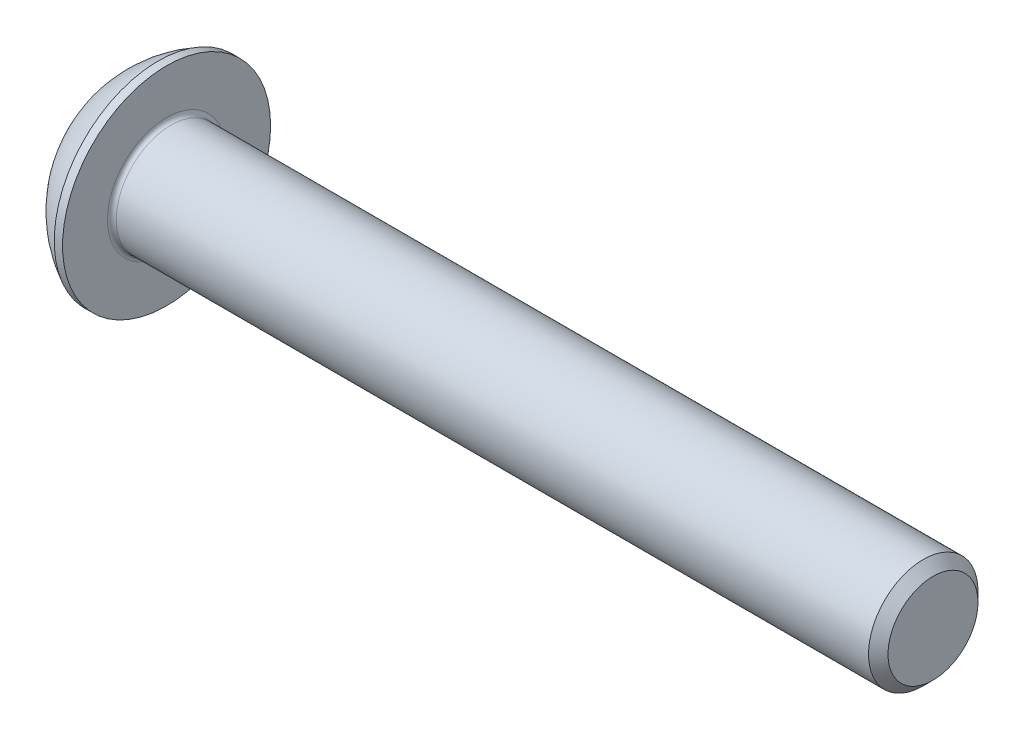
ISO-10303-21;
HEADER;
FILE_DESCRIPTION(('STEP AP214'),'2;1');
FILE_NAME('part.step','',(''),(''),'','','');
FILE_SCHEMA(('AUTOMOTIVE_DESIGN { 1 0 10303 214 1 1 1 1 }'));
ENDSEC;
DATA;
#1=APPLICATION_CONTEXT('core data for automotive mechanical design processes');
#2=APPLICATION_PROTOCOL_DEFINITION('international standard','automotive_design',2000,#1);
#3=PRODUCT_CONTEXT('',#1,'mechanical');
#4=PRODUCT('Part','Part','',(#3));
#5=PRODUCT_RELATED_PRODUCT_CATEGORY('part','',(#4));
#6=PRODUCT_DEFINITION_FORMATION('','',#4);
#7=PRODUCT_DEFINITION_CONTEXT('part definition',#1,'design');
#8=PRODUCT_DEFINITION('design','',#6,#7);
#9=PRODUCT_DEFINITION_SHAPE('','',#8);
#10=(LENGTH_UNIT() NAMED_UNIT(*) SI_UNIT(.MILLI.,.METRE.));
#11=(NAMED_UNIT(*) PLANE_ANGLE_UNIT() SI_UNIT($,.RADIAN.));
#12=(NAMED_UNIT(*) SI_UNIT($,.STERADIAN.) SOLID_ANGLE_UNIT());
#13=UNCERTAINTY_MEASURE_WITH_UNIT(LENGTH_MEASURE(1.E-05),#10,'distance_accuracy_value','');
#14=(GEOMETRIC_REPRESENTATION_CONTEXT(3) GLOBAL_UNCERTAINTY_ASSIGNED_CONTEXT((#13)) GLOBAL_UNIT_ASSIGNED_CONTEXT((#10,
#11,#12)) REPRESENTATION_CONTEXT('',''));
#15=CARTESIAN_POINT('',(0.,0.,0.));
#16=DIRECTION('',(0.,0.,1.));
#17=DIRECTION('',(1.,0.,0.));
#18=AXIS2_PLACEMENT_3D('',#15,#16,#17);
#19=CARTESIAN_POINT('',(4.75485015536768,0.,0.));
#20=DIRECTION('',(1.,0.,0.));
#21=DIRECTION('',(0.,1.,0.));
#22=AXIS2_PLACEMENT_3D('',#19,#20,#21);
#23=SPHERICAL_SURFACE('',#22,5.315);
#24=CARTESIAN_POINT('',(0.,0.,0.));
#25=DIRECTION('',(1.,0.,0.));
#26=DIRECTION('',(0.,0.,-1.));
#27=AXIS2_PLACEMENT_3D('',#24,#25,#26);
#28=CIRCLE('',#27,2.375);
#29=CARTESIAN_POINT('',(0.,0.,-2.375));
#30=VERTEX_POINT('',#29);
#31=EDGE_CURVE('E190',#30,#30,#28,.T.);
#32=ORIENTED_EDGE('',*,*,#31,.T.);
#33=EDGE_LOOP('',(#32));
#34=FACE_BOUND('',#33,.T.);
#35=CARTESIAN_POINT('',(2.37016464151056,0.,0.));
#36=DIRECTION('',(1.,0.,0.));
#37=DIRECTION('',(0.,0.,-1.));
#38=AXIS2_PLACEMENT_3D('',#35,#36,#37);
#39=CIRCLE('',#38,4.75);
#40=CARTESIAN_POINT('',(2.37016464151056,0.,-4.75));
#41=VERTEX_POINT('',#40);
#42=EDGE_CURVE('E177',#41,#41,#39,.T.);
#43=ORIENTED_EDGE('',*,*,#42,.F.);
#44=EDGE_LOOP('',(#43));
#45=FACE_BOUND('',#44,.T.);
#46=ADVANCED_FACE('F34',(#34,#45),#23,.T.);
#47=CARTESIAN_POINT('',(0.,2.375,0.));
#48=DIRECTION('',(-1.,0.,0.));
#49=DIRECTION('',(0.,0.,1.));
#50=AXIS2_PLACEMENT_3D('',#47,#48,#49);
#51=PLANE('',#50);
#52=DIRECTION('',(0.,0.5,-0.866025403784439));
#53=VECTOR('',#52,1.);
#54=CARTESIAN_POINT('',(0.,0.866025403784439,1.5));
#55=LINE('',#54,#53);
#56=CARTESIAN_POINT('',(0.,0.866025403784439,1.5));
#57=VERTEX_POINT('',#56);
#58=CARTESIAN_POINT('',(0.,1.73205080756888,0.));
#59=VERTEX_POINT('',#58);
#60=EDGE_CURVE('E156',#57,#59,#55,.T.);
#61=ORIENTED_EDGE('',*,*,#60,.F.);
#62=DIRECTION('',(0.,1.,0.));
#63=VECTOR('',#62,1.);
#64=CARTESIAN_POINT('',(0.,-0.866025403784438,1.5));
#65=LINE('',#64,#63);
#66=CARTESIAN_POINT('',(0.,-0.866025403784438,1.5));
#67=VERTEX_POINT('',#66);
#68=EDGE_CURVE('E153',#67,#57,#65,.T.);
#69=ORIENTED_EDGE('',*,*,#68,.F.);
#70=DIRECTION('',(0.,0.5,0.866025403784438));
#71=VECTOR('',#70,1.);
#72=CARTESIAN_POINT('',(0.,-1.73205080756888,0.));
#73=LINE('',#72,#71);
#74=CARTESIAN_POINT('',(0.,-1.73205080756888,0.));
#75=VERTEX_POINT('',#74);
#76=EDGE_CURVE('E151',#75,#67,#73,.T.);
#77=ORIENTED_EDGE('',*,*,#76,.F.);
#78=DIRECTION('',(0.,-0.5,0.866025403784438));
#79=VECTOR('',#78,1.);
#80=CARTESIAN_POINT('',(0.,-0.866025403784438,-1.5));
#81=LINE('',#80,#79);
#82=CARTESIAN_POINT('',(0.,-0.866025403784438,-1.5));
#83=VERTEX_POINT('',#82);
#84=EDGE_CURVE('E149',#83,#75,#81,.T.);
#85=ORIENTED_EDGE('',*,*,#84,.F.);
#86=DIRECTION('',(0.,-1.,0.));
#87=VECTOR('',#86,1.);
#88=CARTESIAN_POINT('',(0.,0.866025403784438,-1.5));
#89=LINE('',#88,#87);
#90=CARTESIAN_POINT('',(0.,0.866025403784438,-1.5));
#91=VERTEX_POINT('',#90);
#92=EDGE_CURVE('E123',#91,#83,#89,.T.);
#93=ORIENTED_EDGE('',*,*,#92,.F.);
#94=DIRECTION('',(0.,-0.5,-0.866025403784438));
#95=VECTOR('',#94,1.);
#96=CARTESIAN_POINT('',(0.,1.73205080756888,0.));
#97=LINE('',#96,#95);
#98=EDGE_CURVE('E116',#59,#91,#97,.T.);
#99=ORIENTED_EDGE('',*,*,#98,.F.);
#100=EDGE_LOOP('',(#61,#69,#77,#85,#93,#99));
#101=FACE_BOUND('',#100,.T.);
#102=ORIENTED_EDGE('',*,*,#31,.F.);
#103=EDGE_LOOP('',(#102));
#104=FACE_BOUND('',#103,.T.);
#105=ADVANCED_FACE('F212',(#101,#104),#51,.T.);
#106=CARTESIAN_POINT('',(37.75,0.,0.));
#107=DIRECTION('',(1.,0.,0.));
#108=DIRECTION('',(0.,0.,-1.));
#109=AXIS2_PLACEMENT_3D('',#106,#107,#108);
#110=PLANE('',#109);
#111=CARTESIAN_POINT('',(37.75,0.,0.));
#112=DIRECTION('',(1.,0.,0.));
#113=DIRECTION('',(0.,0.,-1.));
#114=AXIS2_PLACEMENT_3D('',#111,#112,#113);
#115=CIRCLE('',#114,2.05500000000001);
#116=CARTESIAN_POINT('',(37.75,0.,-2.05500000000001));
#117=VERTEX_POINT('',#116);
#118=EDGE_CURVE('E187',#117,#117,#115,.T.);
#119=ORIENTED_EDGE('',*,*,#118,.T.);
#120=EDGE_LOOP('',(#119));
#121=FACE_BOUND('',#120,.T.);
#122=ADVANCED_FACE('F217',(#121),#110,.T.);
#123=CARTESIAN_POINT('',(37.75,0.,0.));
#124=DIRECTION('',(-1.,0.,0.));
#125=DIRECTION('',(0.,0.,1.));
#126=AXIS2_PLACEMENT_3D('',#123,#124,#125);
#127=CONICAL_SURFACE('',#126,2.05500000000001,0.785398163397447);
#128=CARTESIAN_POINT('',(37.305,0.,0.));
#129=DIRECTION('',(1.,0.,0.));
#130=DIRECTION('',(0.,0.,-1.));
#131=AXIS2_PLACEMENT_3D('',#128,#129,#130);
#132=CIRCLE('',#131,2.5);
#133=CARTESIAN_POINT('',(37.305,0.,-2.5));
#134=VERTEX_POINT('',#133);
#135=EDGE_CURVE('E184',#134,#134,#132,.T.);
#136=ORIENTED_EDGE('',*,*,#135,.T.);
#137=EDGE_LOOP('',(#136));
#138=FACE_BOUND('',#137,.T.);
#139=ORIENTED_EDGE('',*,*,#118,.F.);
#140=EDGE_LOOP('',(#139));
#141=FACE_BOUND('',#140,.T.);
#142=ADVANCED_FACE('F224',(#138,#141),#127,.T.);
#143=CARTESIAN_POINT('',(-3.64348996551984,0.,0.));
#144=DIRECTION('',(1.,0.,0.));
#145=DIRECTION('',(0.,0.,-1.));
#146=AXIS2_PLACEMENT_3D('',#143,#144,#145);
#147=CYLINDRICAL_SURFACE('',#146,2.5);
#148=CARTESIAN_POINT('',(2.95,0.,0.));
#149=DIRECTION('',(1.,0.,0.));
#150=DIRECTION('',(0.,0.,-1.));
#151=AXIS2_PLACEMENT_3D('',#148,#149,#150);
#152=CIRCLE('',#151,2.5);
#153=CARTESIAN_POINT('',(2.95,0.,-2.5));
#154=VERTEX_POINT('',#153);
#155=EDGE_CURVE('E42',#154,#154,#152,.T.);
#156=ORIENTED_EDGE('',*,*,#155,.T.);
#157=EDGE_LOOP('',(#156));
#158=FACE_BOUND('',#157,.T.);
#159=ORIENTED_EDGE('',*,*,#135,.F.);
#160=EDGE_LOOP('',(#159));
#161=FACE_BOUND('',#160,.T.);
#162=ADVANCED_FACE('F195',(#158,#161),#147,.T.);
#163=CARTESIAN_POINT('',(2.75,2.5,0.));
#164=DIRECTION('',(1.,0.,0.));
#165=DIRECTION('',(0.,0.,-1.));
#166=AXIS2_PLACEMENT_3D('',#163,#164,#165);
#167=PLANE('',#166);
#168=CARTESIAN_POINT('',(2.75,0.,0.));
#169=DIRECTION('',(1.,0.,0.));
#170=DIRECTION('',(0.,0.,-1.));
#171=AXIS2_PLACEMENT_3D('',#168,#169,#170);
#172=CIRCLE('',#171,2.7);
#173=CARTESIAN_POINT('',(2.75,0.,-2.7));
#174=VERTEX_POINT('',#173);
#175=EDGE_CURVE('E11',#174,#174,#172,.F.);
#176=ORIENTED_EDGE('',*,*,#175,.T.);
#177=EDGE_LOOP('',(#176));
#178=FACE_BOUND('',#177,.T.);
#179=CARTESIAN_POINT('',(2.75,0.,0.));
#180=DIRECTION('',(1.,0.,0.));
#181=DIRECTION('',(0.,0.,-1.));
#182=AXIS2_PLACEMENT_3D('',#179,#180,#181);
#183=CIRCLE('',#182,4.75);
#184=CARTESIAN_POINT('',(2.75,0.,-4.75));
#185=VERTEX_POINT('',#184);
#186=EDGE_CURVE('E181',#185,#185,#183,.T.);
#187=ORIENTED_EDGE('',*,*,#186,.T.);
#188=EDGE_LOOP('',(#187));
#189=FACE_BOUND('',#188,.T.);
#190=ADVANCED_FACE('F207',(#178,#189),#167,.T.);
#191=CARTESIAN_POINT('',(-3.64348996551984,0.,0.));
#192=DIRECTION('',(1.,0.,0.));
#193=DIRECTION('',(0.,0.,-1.));
#194=AXIS2_PLACEMENT_3D('',#191,#192,#193);
#195=CYLINDRICAL_SURFACE('',#194,4.75);
#196=ORIENTED_EDGE('',*,*,#42,.T.);
#197=EDGE_LOOP('',(#196));
#198=FACE_BOUND('',#197,.T.);
#199=ORIENTED_EDGE('',*,*,#186,.F.);
#200=EDGE_LOOP('',(#199));
#201=FACE_BOUND('',#200,.T.);
#202=ADVANCED_FACE('F199',(#198,#201),#195,.T.);
#203=CARTESIAN_POINT('',(2.95,0.,0.));
#204=DIRECTION('',(1.,0.,0.));
#205=DIRECTION('',(0.,0.,-1.));
#206=AXIS2_PLACEMENT_3D('',#203,#204,#205);
#207=TOROIDAL_SURFACE('',#206,2.7,0.2);
#208=ORIENTED_EDGE('',*,*,#175,.F.);
#209=EDGE_LOOP('',(#208));
#210=FACE_BOUND('',#209,.T.);
#211=ORIENTED_EDGE('',*,*,#155,.F.);
#212=EDGE_LOOP('',(#211));
#213=FACE_BOUND('',#212,.T.);
#214=ADVANCED_FACE('F36',(#210,#213),#207,.F.);
#215=CARTESIAN_POINT('',(1.56,0.866025403784438,-1.5));
#216=DIRECTION('',(0.,0.,-1.));
#217=DIRECTION('',(-1.,0.,0.));
#218=AXIS2_PLACEMENT_3D('',#215,#216,#217);
#219=PLANE('',#218);
#220=DIRECTION('',(0.,-1.,0.));
#221=VECTOR('',#220,1.);
#222=CARTESIAN_POINT('',(1.56,0.866025403784438,-1.5));
#223=LINE('',#222,#221);
#224=CARTESIAN_POINT('',(1.56,0.866025403784438,-1.5));
#225=VERTEX_POINT('',#224);
#226=CARTESIAN_POINT('',(1.56,0.,-1.5));
#227=VERTEX_POINT('',#226);
#228=EDGE_CURVE('E115',#225,#227,#223,.T.);
#229=ORIENTED_EDGE('',*,*,#228,.F.);
#230=DIRECTION('',(-1.,0.,0.));
#231=VECTOR('',#230,1.);
#232=CARTESIAN_POINT('',(1.56,0.866025403784438,-1.5));
#233=LINE('',#232,#231);
#234=EDGE_CURVE('E161',#225,#91,#233,.T.);
#235=ORIENTED_EDGE('',*,*,#234,.T.);
#236=ORIENTED_EDGE('',*,*,#92,.T.);
#237=DIRECTION('',(-1.,0.,0.));
#238=VECTOR('',#237,1.);
#239=CARTESIAN_POINT('',(1.56,-0.866025403784438,-1.5));
#240=LINE('',#239,#238);
#241=CARTESIAN_POINT('',(1.56,-0.866025403784438,-1.5));
#242=VERTEX_POINT('',#241);
#243=EDGE_CURVE('E120',#242,#83,#240,.T.);
#244=ORIENTED_EDGE('',*,*,#243,.F.);
#245=EDGE_CURVE('E105',#227,#242,#223,.T.);
#246=ORIENTED_EDGE('',*,*,#245,.F.);
#247=EDGE_LOOP('',(#229,#235,#236,#244,#246));
#248=FACE_BOUND('',#247,.T.);
#249=ADVANCED_FACE('F121',(#248),#219,.F.);
#250=CARTESIAN_POINT('',(1.56,1.73205080756888,0.));
#251=DIRECTION('',(0.,0.866025403784438,-0.5));
#252=DIRECTION('',(0.,0.5,0.866025403784439));
#253=AXIS2_PLACEMENT_3D('',#250,#251,#252);
#254=PLANE('',#253);
#255=DIRECTION('',(0.,-0.5,-0.866025403784438));
#256=VECTOR('',#255,1.);
#257=CARTESIAN_POINT('',(1.56,1.73205080756888,0.));
#258=LINE('',#257,#256);
#259=CARTESIAN_POINT('',(1.56,1.73205080756888,0.));
#260=VERTEX_POINT('',#259);
#261=CARTESIAN_POINT('',(1.56,1.29903810567666,-0.75));
#262=VERTEX_POINT('',#261);
#263=EDGE_CURVE('E127',#260,#262,#258,.T.);
#264=ORIENTED_EDGE('',*,*,#263,.F.);
#265=DIRECTION('',(-1.,0.,0.));
#266=VECTOR('',#265,1.);
#267=CARTESIAN_POINT('',(1.56,1.73205080756888,0.));
#268=LINE('',#267,#266);
#269=EDGE_CURVE('E164',#260,#59,#268,.T.);
#270=ORIENTED_EDGE('',*,*,#269,.T.);
#271=ORIENTED_EDGE('',*,*,#98,.T.);
#272=ORIENTED_EDGE('',*,*,#234,.F.);
#273=EDGE_CURVE('E145',#262,#225,#258,.T.);
#274=ORIENTED_EDGE('',*,*,#273,.F.);
#275=EDGE_LOOP('',(#264,#270,#271,#272,#274));
#276=FACE_BOUND('',#275,.T.);
#277=ADVANCED_FACE('F205',(#276),#254,.F.);
#278=CARTESIAN_POINT('',(1.56,0.866025403784439,1.5));
#279=DIRECTION('',(0.,0.866025403784439,0.5));
#280=DIRECTION('',(0.,-0.5,0.866025403784439));
#281=AXIS2_PLACEMENT_3D('',#278,#279,#280);
#282=PLANE('',#281);
#283=DIRECTION('',(0.,0.5,-0.866025403784439));
#284=VECTOR('',#283,1.);
#285=CARTESIAN_POINT('',(1.56,0.866025403784439,1.5));
#286=LINE('',#285,#284);
#287=CARTESIAN_POINT('',(1.56,0.866025403784439,1.5));
#288=VERTEX_POINT('',#287);
#289=CARTESIAN_POINT('',(1.56,1.29903810567666,0.75));
#290=VERTEX_POINT('',#289);
#291=EDGE_CURVE('E49',#288,#290,#286,.T.);
#292=ORIENTED_EDGE('',*,*,#291,.F.);
#293=DIRECTION('',(-1.,0.,0.));
#294=VECTOR('',#293,1.);
#295=CARTESIAN_POINT('',(1.56,0.866025403784439,1.5));
#296=LINE('',#295,#294);
#297=EDGE_CURVE('E167',#288,#57,#296,.T.);
#298=ORIENTED_EDGE('',*,*,#297,.T.);
#299=ORIENTED_EDGE('',*,*,#60,.T.);
#300=ORIENTED_EDGE('',*,*,#269,.F.);
#301=EDGE_CURVE('E143',#290,#260,#286,.T.);
#302=ORIENTED_EDGE('',*,*,#301,.F.);
#303=EDGE_LOOP('',(#292,#298,#299,#300,#302));
#304=FACE_BOUND('',#303,.T.);
#305=ADVANCED_FACE('F249',(#304),#282,.F.);
#306=CARTESIAN_POINT('',(1.56,-0.866025403784438,1.5));
#307=DIRECTION('',(0.,0.,1.));
#308=DIRECTION('',(0.,-1.,0.));
#309=AXIS2_PLACEMENT_3D('',#306,#307,#308);
#310=PLANE('',#309);
#311=DIRECTION('',(0.,1.,0.));
#312=VECTOR('',#311,1.);
#313=CARTESIAN_POINT('',(1.56,-0.866025403784438,1.5));
#314=LINE('',#313,#312);
#315=CARTESIAN_POINT('',(1.56,-0.866025403784438,1.5));
#316=VERTEX_POINT('',#315);
#317=CARTESIAN_POINT('',(1.56,0.,1.5));
#318=VERTEX_POINT('',#317);
#319=EDGE_CURVE('E140',#316,#318,#314,.T.);
#320=ORIENTED_EDGE('',*,*,#319,.F.);
#321=DIRECTION('',(-1.,0.,0.));
#322=VECTOR('',#321,1.);
#323=CARTESIAN_POINT('',(1.56,-0.866025403784438,1.5));
#324=LINE('',#323,#322);
#325=EDGE_CURVE('E170',#316,#67,#324,.T.);
#326=ORIENTED_EDGE('',*,*,#325,.T.);
#327=ORIENTED_EDGE('',*,*,#68,.T.);
#328=ORIENTED_EDGE('',*,*,#297,.F.);
#329=EDGE_CURVE('E139',#318,#288,#314,.T.);
#330=ORIENTED_EDGE('',*,*,#329,.F.);
#331=EDGE_LOOP('',(#320,#326,#327,#328,#330));
#332=FACE_BOUND('',#331,.T.);
#333=ADVANCED_FACE('F245',(#332),#310,.F.);
#334=CARTESIAN_POINT('',(1.56,-1.73205080756888,0.));
#335=DIRECTION('',(0.,-0.866025403784438,0.5));
#336=DIRECTION('',(0.,-0.5,-0.866025403784439));
#337=AXIS2_PLACEMENT_3D('',#334,#335,#336);
#338=PLANE('',#337);
#339=DIRECTION('',(0.,0.5,0.866025403784438));
#340=VECTOR('',#339,1.);
#341=CARTESIAN_POINT('',(1.56,-1.73205080756888,0.));
#342=LINE('',#341,#340);
#343=CARTESIAN_POINT('',(1.56,-1.73205080756888,0.));
#344=VERTEX_POINT('',#343);
#345=CARTESIAN_POINT('',(1.56,-1.29903810567666,0.75));
#346=VERTEX_POINT('',#345);
#347=EDGE_CURVE('E135',#344,#346,#342,.T.);
#348=ORIENTED_EDGE('',*,*,#347,.F.);
#349=DIRECTION('',(-1.,0.,0.));
#350=VECTOR('',#349,1.);
#351=CARTESIAN_POINT('',(1.56,-1.73205080756888,0.));
#352=LINE('',#351,#350);
#353=EDGE_CURVE('E126',#344,#75,#352,.T.);
#354=ORIENTED_EDGE('',*,*,#353,.T.);
#355=ORIENTED_EDGE('',*,*,#76,.T.);
#356=ORIENTED_EDGE('',*,*,#325,.F.);
#357=EDGE_CURVE('E133',#346,#316,#342,.T.);
#358=ORIENTED_EDGE('',*,*,#357,.F.);
#359=EDGE_LOOP('',(#348,#354,#355,#356,#358));
#360=FACE_BOUND('',#359,.T.);
#361=ADVANCED_FACE('F242',(#360),#338,.F.);
#362=CARTESIAN_POINT('',(1.56,-0.866025403784438,-1.5));
#363=DIRECTION('',(0.,-0.866025403784438,-0.5));
#364=DIRECTION('',(0.,0.5,-0.866025403784439));
#365=AXIS2_PLACEMENT_3D('',#362,#363,#364);
#366=PLANE('',#365);
#367=DIRECTION('',(0.,-0.5,0.866025403784438));
#368=VECTOR('',#367,1.);
#369=CARTESIAN_POINT('',(1.56,-0.866025403784438,-1.5));
#370=LINE('',#369,#368);
#371=CARTESIAN_POINT('',(1.56,-1.29903810567666,-0.75));
#372=VERTEX_POINT('',#371);
#373=EDGE_CURVE('E109',#242,#372,#370,.T.);
#374=ORIENTED_EDGE('',*,*,#373,.F.);
#375=ORIENTED_EDGE('',*,*,#243,.T.);
#376=ORIENTED_EDGE('',*,*,#84,.T.);
#377=ORIENTED_EDGE('',*,*,#353,.F.);
#378=EDGE_CURVE('E132',#372,#344,#370,.T.);
#379=ORIENTED_EDGE('',*,*,#378,.F.);
#380=EDGE_LOOP('',(#374,#375,#376,#377,#379));
#381=FACE_BOUND('',#380,.T.);
#382=ADVANCED_FACE('F130',(#381),#366,.F.);
#383=CARTESIAN_POINT('',(1.56,0.,0.));
#384=DIRECTION('',(-1.,0.,0.));
#385=DIRECTION('',(0.,0.,1.));
#386=AXIS2_PLACEMENT_3D('',#383,#384,#385);
#387=PLANE('',#386);
#388=CARTESIAN_POINT('',(1.56,0.,0.));
#389=DIRECTION('',(1.,0.,0.));
#390=DIRECTION('',(0.,1.,0.));
#391=AXIS2_PLACEMENT_3D('',#388,#389,#390);
#392=CIRCLE('',#391,1.5);
#393=EDGE_CURVE('E178',#318,#346,#392,.T.);
#394=ORIENTED_EDGE('',*,*,#393,.T.);
#395=ORIENTED_EDGE('',*,*,#357,.T.);
#396=ORIENTED_EDGE('',*,*,#319,.T.);
#397=EDGE_LOOP('',(#394,#395,#396));
#398=FACE_BOUND('',#397,.T.);
#399=ADVANCED_FACE('F241',(#398),#387,.T.);
#400=EDGE_CURVE('E280',#346,#372,#392,.T.);
#401=ORIENTED_EDGE('',*,*,#400,.T.);
#402=ORIENTED_EDGE('',*,*,#378,.T.);
#403=ORIENTED_EDGE('',*,*,#347,.T.);
#404=EDGE_LOOP('',(#401,#402,#403));
#405=FACE_BOUND('',#404,.T.);
#406=ADVANCED_FACE('F258',(#405),#387,.T.);
#407=EDGE_CURVE('E111',#372,#227,#392,.T.);
#408=ORIENTED_EDGE('',*,*,#407,.T.);
#409=ORIENTED_EDGE('',*,*,#245,.T.);
#410=ORIENTED_EDGE('',*,*,#373,.T.);
#411=EDGE_LOOP('',(#408,#409,#410));
#412=FACE_BOUND('',#411,.T.);
#413=ADVANCED_FACE('F107',(#412),#387,.T.);
#414=EDGE_CURVE('E281',#227,#262,#392,.T.);
#415=ORIENTED_EDGE('',*,*,#414,.T.);
#416=ORIENTED_EDGE('',*,*,#273,.T.);
#417=ORIENTED_EDGE('',*,*,#228,.T.);
#418=EDGE_LOOP('',(#415,#416,#417));
#419=FACE_BOUND('',#418,.T.);
#420=ADVANCED_FACE('F269',(#419),#387,.T.);
#421=EDGE_CURVE('E163',#262,#290,#392,.T.);
#422=ORIENTED_EDGE('',*,*,#421,.T.);
#423=ORIENTED_EDGE('',*,*,#301,.T.);
#424=ORIENTED_EDGE('',*,*,#263,.T.);
#425=EDGE_LOOP('',(#422,#423,#424));
#426=FACE_BOUND('',#425,.T.);
#427=ADVANCED_FACE('F265',(#426),#387,.T.);
#428=EDGE_CURVE('E175',#290,#318,#392,.T.);
#429=ORIENTED_EDGE('',*,*,#428,.T.);
#430=ORIENTED_EDGE('',*,*,#329,.T.);
#431=ORIENTED_EDGE('',*,*,#291,.T.);
#432=EDGE_LOOP('',(#429,#430,#431));
#433=FACE_BOUND('',#432,.T.);
#434=ADVANCED_FACE('F236',(#433),#387,.T.);
#435=CARTESIAN_POINT('',(2.42602540378445,0.,0.));
#436=DIRECTION('',(-1.,0.,0.));
#437=DIRECTION('',(0.,-1.,0.));
#438=AXIS2_PLACEMENT_3D('',#435,#436,#437);
#439=CONICAL_SURFACE('',#438,0.,1.04719755119659);
#440=ORIENTED_EDGE('',*,*,#428,.F.);
#441=ORIENTED_EDGE('',*,*,#421,.F.);
#442=ORIENTED_EDGE('',*,*,#414,.F.);
#443=ORIENTED_EDGE('',*,*,#407,.F.);
#444=ORIENTED_EDGE('',*,*,#400,.F.);
#445=ORIENTED_EDGE('',*,*,#393,.F.);
#446=EDGE_LOOP('',(#440,#441,#442,#443,#444,#445));
#447=FACE_BOUND('',#446,.T.);
#448=CARTESIAN_POINT('',(2.42602540378445,0.,0.));
#449=VERTEX_POINT('',#448);
#450=VERTEX_LOOP('',#449);
#451=FACE_BOUND('',#450,.T.);
#452=ADVANCED_FACE('F234',(#447,#451),#439,.F.);
#453=CLOSED_SHELL('',(#46,#105,#122,#142,#162,#190,#202,#214,#249,#277,#305,#333,#361,#382,#399,
#406,#413,#420,#427,#434,#452));
#454=MANIFOLD_SOLID_BREP('B2',#453);
#455=ADVANCED_BREP_SHAPE_REPRESENTATION('',(#18,#454),#14);
#456=SHAPE_DEFINITION_REPRESENTATION(#9,#455);
ENDSEC;
END-ISO-10303-21;
